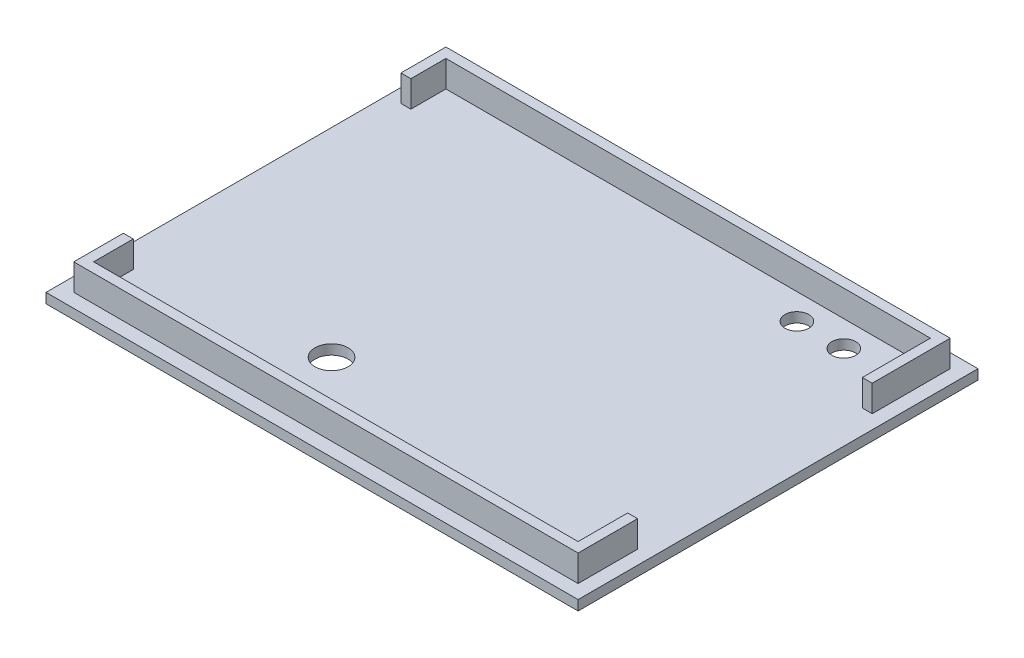
ISO-10303-21;
HEADER;
FILE_DESCRIPTION(('STEP AP214'),'2;1');
FILE_NAME('part.step','',(''),(''),'','','');
FILE_SCHEMA(('AUTOMOTIVE_DESIGN { 1 0 10303 214 1 1 1 1 }'));
ENDSEC;
DATA;
#1=APPLICATION_CONTEXT('core data for automotive mechanical design processes');
#2=APPLICATION_PROTOCOL_DEFINITION('international standard','automotive_design',2000,#1);
#3=PRODUCT_CONTEXT('',#1,'mechanical');
#4=PRODUCT('Part','Part','',(#3));
#5=PRODUCT_RELATED_PRODUCT_CATEGORY('part','',(#4));
#6=PRODUCT_DEFINITION_FORMATION('','',#4);
#7=PRODUCT_DEFINITION_CONTEXT('part definition',#1,'design');
#8=PRODUCT_DEFINITION('design','',#6,#7);
#9=PRODUCT_DEFINITION_SHAPE('','',#8);
#10=(LENGTH_UNIT() NAMED_UNIT(*) SI_UNIT(.MILLI.,.METRE.));
#11=(NAMED_UNIT(*) PLANE_ANGLE_UNIT() SI_UNIT($,.RADIAN.));
#12=(NAMED_UNIT(*) SI_UNIT($,.STERADIAN.) SOLID_ANGLE_UNIT());
#13=UNCERTAINTY_MEASURE_WITH_UNIT(LENGTH_MEASURE(1.E-05),#10,'distance_accuracy_value','');
#14=(GEOMETRIC_REPRESENTATION_CONTEXT(3) GLOBAL_UNCERTAINTY_ASSIGNED_CONTEXT((#13)) GLOBAL_UNIT_ASSIGNED_CONTEXT((#10,
#11,#12)) REPRESENTATION_CONTEXT('',''));
#15=CARTESIAN_POINT('',(0.,0.,0.));
#16=DIRECTION('',(0.,0.,1.));
#17=DIRECTION('',(1.,0.,0.));
#18=AXIS2_PLACEMENT_3D('',#15,#16,#17);
#19=CARTESIAN_POINT('',(0.,5.5,0.));
#20=DIRECTION('',(0.,-1.,0.));
#21=DIRECTION('',(0.,0.,-1.));
#22=AXIS2_PLACEMENT_3D('',#19,#20,#21);
#23=PLANE('',#22);
#24=DIRECTION('',(0.,0.,1.));
#25=VECTOR('',#24,1.);
#26=CARTESIAN_POINT('',(-36.65,5.5,26.65));
#27=LINE('',#26,#25);
#28=CARTESIAN_POINT('',(-36.65,5.5,20.65));
#29=VERTEX_POINT('',#28);
#30=CARTESIAN_POINT('',(-36.65,5.5,26.65));
#31=VERTEX_POINT('',#30);
#32=EDGE_CURVE('E204',#29,#31,#27,.T.);
#33=ORIENTED_EDGE('',*,*,#32,.F.);
#34=DIRECTION('',(1.,0.,0.));
#35=VECTOR('',#34,1.);
#36=CARTESIAN_POINT('',(-36.4,5.5,20.65));
#37=LINE('',#36,#35);
#38=CARTESIAN_POINT('',(-38.15,5.5,20.65));
#39=VERTEX_POINT('',#38);
#40=EDGE_CURVE('E196',#39,#29,#37,.T.);
#41=ORIENTED_EDGE('',*,*,#40,.F.);
#42=DIRECTION('',(0.,0.,1.));
#43=VECTOR('',#42,1.);
#44=CARTESIAN_POINT('',(-38.15,5.5,28.15));
#45=LINE('',#44,#43);
#46=CARTESIAN_POINT('',(-38.15,5.5,28.15));
#47=VERTEX_POINT('',#46);
#48=EDGE_CURVE('E244',#39,#47,#45,.T.);
#49=ORIENTED_EDGE('',*,*,#48,.T.);
#50=DIRECTION('',(1.,0.,0.));
#51=VECTOR('',#50,1.);
#52=CARTESIAN_POINT('',(38.15,5.5,28.15));
#53=LINE('',#52,#51);
#54=CARTESIAN_POINT('',(38.15,5.5,28.15));
#55=VERTEX_POINT('',#54);
#56=EDGE_CURVE('E234',#47,#55,#53,.T.);
#57=ORIENTED_EDGE('',*,*,#56,.T.);
#58=DIRECTION('',(0.,0.,-1.));
#59=VECTOR('',#58,1.);
#60=CARTESIAN_POINT('',(38.15,5.5,28.15));
#61=LINE('',#60,#59);
#62=CARTESIAN_POINT('',(38.15,5.5,19.15));
#63=VERTEX_POINT('',#62);
#64=EDGE_CURVE('E239',#55,#63,#61,.T.);
#65=ORIENTED_EDGE('',*,*,#64,.T.);
#66=DIRECTION('',(1.,0.,0.));
#67=VECTOR('',#66,1.);
#68=CARTESIAN_POINT('',(36.4,5.5,19.15));
#69=LINE('',#68,#67);
#70=CARTESIAN_POINT('',(36.65,5.5,19.15));
#71=VERTEX_POINT('',#70);
#72=EDGE_CURVE('E321',#71,#63,#69,.T.);
#73=ORIENTED_EDGE('',*,*,#72,.F.);
#74=DIRECTION('',(0.,0.,-1.));
#75=VECTOR('',#74,1.);
#76=CARTESIAN_POINT('',(36.65,5.5,26.65));
#77=LINE('',#76,#75);
#78=CARTESIAN_POINT('',(36.65,5.5,26.65));
#79=VERTEX_POINT('',#78);
#80=EDGE_CURVE('E338',#79,#71,#77,.T.);
#81=ORIENTED_EDGE('',*,*,#80,.F.);
#82=DIRECTION('',(1.,0.,0.));
#83=VECTOR('',#82,1.);
#84=CARTESIAN_POINT('',(36.65,5.5,26.65));
#85=LINE('',#84,#83);
#86=EDGE_CURVE('E203',#31,#79,#85,.T.);
#87=ORIENTED_EDGE('',*,*,#86,.F.);
#88=EDGE_LOOP('',(#33,#41,#49,#57,#65,#73,#81,#87));
#89=FACE_BOUND('',#88,.T.);
#90=ADVANCED_FACE('F37',(#89),#23,.F.);
#91=CARTESIAN_POINT('',(-38.15,5.5,28.15));
#92=DIRECTION('',(1.,0.,0.));
#93=DIRECTION('',(0.,0.,-1.));
#94=AXIS2_PLACEMENT_3D('',#91,#92,#93);
#95=PLANE('',#94);
#96=ORIENTED_EDGE('',*,*,#48,.F.);
#97=DIRECTION('',(0.,-1.,0.));
#98=VECTOR('',#97,1.);
#99=CARTESIAN_POINT('',(-38.15,5.5,20.65));
#100=LINE('',#99,#98);
#101=CARTESIAN_POINT('',(-38.15,1.5,20.65));
#102=VERTEX_POINT('',#101);
#103=EDGE_CURVE('E318',#39,#102,#100,.T.);
#104=ORIENTED_EDGE('',*,*,#103,.T.);
#105=DIRECTION('',(0.,0.,1.));
#106=VECTOR('',#105,1.);
#107=CARTESIAN_POINT('',(-38.15,1.5,28.15));
#108=LINE('',#107,#106);
#109=CARTESIAN_POINT('',(-38.15,1.5,28.15));
#110=VERTEX_POINT('',#109);
#111=EDGE_CURVE('E256',#102,#110,#108,.T.);
#112=ORIENTED_EDGE('',*,*,#111,.T.);
#113=DIRECTION('',(0.,-1.,0.));
#114=VECTOR('',#113,1.);
#115=CARTESIAN_POINT('',(-38.15,5.5,28.15));
#116=LINE('',#115,#114);
#117=EDGE_CURVE('E246',#47,#110,#116,.T.);
#118=ORIENTED_EDGE('',*,*,#117,.F.);
#119=EDGE_LOOP('',(#96,#104,#112,#118));
#120=FACE_BOUND('',#119,.T.);
#121=ADVANCED_FACE('F385',(#120),#95,.F.);
#122=CARTESIAN_POINT('',(-36.65,5.5,26.65));
#123=DIRECTION('',(1.,0.,0.));
#124=DIRECTION('',(0.,0.,-1.));
#125=AXIS2_PLACEMENT_3D('',#122,#123,#124);
#126=PLANE('',#125);
#127=DIRECTION('',(0.,-1.,0.));
#128=VECTOR('',#127,1.);
#129=CARTESIAN_POINT('',(-36.65,5.5,20.65));
#130=LINE('',#129,#128);
#131=CARTESIAN_POINT('',(-36.65,1.5,20.65));
#132=VERTEX_POINT('',#131);
#133=EDGE_CURVE('E316',#29,#132,#130,.T.);
#134=ORIENTED_EDGE('',*,*,#133,.F.);
#135=ORIENTED_EDGE('',*,*,#32,.T.);
#136=DIRECTION('',(0.,-1.,0.));
#137=VECTOR('',#136,1.);
#138=CARTESIAN_POINT('',(-36.65,5.5,26.65));
#139=LINE('',#138,#137);
#140=CARTESIAN_POINT('',(-36.65,1.5,26.65));
#141=VERTEX_POINT('',#140);
#142=EDGE_CURVE('E226',#31,#141,#139,.T.);
#143=ORIENTED_EDGE('',*,*,#142,.T.);
#144=DIRECTION('',(0.,0.,1.));
#145=VECTOR('',#144,1.);
#146=CARTESIAN_POINT('',(-36.65,1.5,26.65));
#147=LINE('',#146,#145);
#148=EDGE_CURVE('E218',#132,#141,#147,.T.);
#149=ORIENTED_EDGE('',*,*,#148,.F.);
#150=EDGE_LOOP('',(#134,#135,#143,#149));
#151=FACE_BOUND('',#150,.T.);
#152=ADVANCED_FACE('F391',(#151),#126,.T.);
#153=CARTESIAN_POINT('',(38.15,5.5,28.15));
#154=DIRECTION('',(-1.,0.,0.));
#155=DIRECTION('',(0.,0.,1.));
#156=AXIS2_PLACEMENT_3D('',#153,#154,#155);
#157=PLANE('',#156);
#158=CARTESIAN_POINT('',(38.15,5.5,-16.35));
#159=VERTEX_POINT('',#158);
#160=CARTESIAN_POINT('',(38.15,5.5,-28.15));
#161=VERTEX_POINT('',#160);
#162=EDGE_CURVE('E237',#159,#161,#61,.T.);
#163=ORIENTED_EDGE('',*,*,#162,.F.);
#164=DIRECTION('',(0.,-1.,0.));
#165=VECTOR('',#164,1.);
#166=CARTESIAN_POINT('',(38.15,5.5,-16.35));
#167=LINE('',#166,#165);
#168=CARTESIAN_POINT('',(38.15,1.5,-16.35));
#169=VERTEX_POINT('',#168);
#170=EDGE_CURVE('E336',#159,#169,#167,.T.);
#171=ORIENTED_EDGE('',*,*,#170,.T.);
#172=DIRECTION('',(0.,0.,-1.));
#173=VECTOR('',#172,1.);
#174=CARTESIAN_POINT('',(38.15,1.5,28.15));
#175=LINE('',#174,#173);
#176=CARTESIAN_POINT('',(38.15,1.5,-28.15));
#177=VERTEX_POINT('',#176);
#178=EDGE_CURVE('E249',#169,#177,#175,.T.);
#179=ORIENTED_EDGE('',*,*,#178,.T.);
#180=DIRECTION('',(0.,-1.,0.));
#181=VECTOR('',#180,1.);
#182=CARTESIAN_POINT('',(38.15,5.5,-28.15));
#183=LINE('',#182,#181);
#184=EDGE_CURVE('E263',#161,#177,#183,.T.);
#185=ORIENTED_EDGE('',*,*,#184,.F.);
#186=EDGE_LOOP('',(#163,#171,#179,#185));
#187=FACE_BOUND('',#186,.T.);
#188=ADVANCED_FACE('F367',(#187),#157,.F.);
#189=CARTESIAN_POINT('',(36.65,5.5,26.65));
#190=DIRECTION('',(-1.,0.,0.));
#191=DIRECTION('',(0.,0.,1.));
#192=AXIS2_PLACEMENT_3D('',#189,#190,#191);
#193=PLANE('',#192);
#194=DIRECTION('',(0.,-1.,0.));
#195=VECTOR('',#194,1.);
#196=CARTESIAN_POINT('',(36.65,5.5,-16.35));
#197=LINE('',#196,#195);
#198=CARTESIAN_POINT('',(36.65,5.5,-16.35));
#199=VERTEX_POINT('',#198);
#200=CARTESIAN_POINT('',(36.65,1.5,-16.35));
#201=VERTEX_POINT('',#200);
#202=EDGE_CURVE('E334',#199,#201,#197,.T.);
#203=ORIENTED_EDGE('',*,*,#202,.F.);
#204=CARTESIAN_POINT('',(36.65,5.5,-26.65));
#205=VERTEX_POINT('',#204);
#206=EDGE_CURVE('E223',#199,#205,#77,.T.);
#207=ORIENTED_EDGE('',*,*,#206,.T.);
#208=DIRECTION('',(0.,-1.,0.));
#209=VECTOR('',#208,1.);
#210=CARTESIAN_POINT('',(36.65,5.5,-26.65));
#211=LINE('',#210,#209);
#212=CARTESIAN_POINT('',(36.65,1.5,-26.65));
#213=VERTEX_POINT('',#212);
#214=EDGE_CURVE('E230',#205,#213,#211,.T.);
#215=ORIENTED_EDGE('',*,*,#214,.T.);
#216=DIRECTION('',(0.,0.,-1.));
#217=VECTOR('',#216,1.);
#218=CARTESIAN_POINT('',(36.65,1.5,26.65));
#219=LINE('',#218,#217);
#220=EDGE_CURVE('E216',#201,#213,#219,.T.);
#221=ORIENTED_EDGE('',*,*,#220,.F.);
#222=EDGE_LOOP('',(#203,#207,#215,#221));
#223=FACE_BOUND('',#222,.T.);
#224=ADVANCED_FACE('F348',(#223),#193,.T.);
#225=CARTESIAN_POINT('',(40.25,1.5,30.25));
#226=DIRECTION('',(-1.,0.,0.));
#227=DIRECTION('',(0.,0.,1.));
#228=AXIS2_PLACEMENT_3D('',#225,#226,#227);
#229=PLANE('',#228);
#230=DIRECTION('',(0.,0.,-1.));
#231=VECTOR('',#230,1.);
#232=CARTESIAN_POINT('',(40.25,0.,30.25));
#233=LINE('',#232,#231);
#234=CARTESIAN_POINT('',(40.25,0.,30.25));
#235=VERTEX_POINT('',#234);
#236=CARTESIAN_POINT('',(40.25,0.,-30.25));
#237=VERTEX_POINT('',#236);
#238=EDGE_CURVE('E268',#235,#237,#233,.T.);
#239=ORIENTED_EDGE('',*,*,#238,.T.);
#240=DIRECTION('',(0.,-1.,0.));
#241=VECTOR('',#240,1.);
#242=CARTESIAN_POINT('',(40.25,1.5,-30.25));
#243=LINE('',#242,#241);
#244=CARTESIAN_POINT('',(40.25,1.5,-30.25));
#245=VERTEX_POINT('',#244);
#246=EDGE_CURVE('E11',#245,#237,#243,.T.);
#247=ORIENTED_EDGE('',*,*,#246,.F.);
#248=DIRECTION('',(0.,0.,-1.));
#249=VECTOR('',#248,1.);
#250=CARTESIAN_POINT('',(40.25,1.5,30.25));
#251=LINE('',#250,#249);
#252=CARTESIAN_POINT('',(40.25,1.5,30.25));
#253=VERTEX_POINT('',#252);
#254=EDGE_CURVE('E269',#253,#245,#251,.T.);
#255=ORIENTED_EDGE('',*,*,#254,.F.);
#256=DIRECTION('',(0.,-1.,0.));
#257=VECTOR('',#256,1.);
#258=CARTESIAN_POINT('',(40.25,1.5,30.25));
#259=LINE('',#258,#257);
#260=EDGE_CURVE('E279',#253,#235,#259,.T.);
#261=ORIENTED_EDGE('',*,*,#260,.T.);
#262=EDGE_LOOP('',(#239,#247,#255,#261));
#263=FACE_BOUND('',#262,.T.);
#264=ADVANCED_FACE('F39',(#263),#229,.F.);
#265=CARTESIAN_POINT('',(40.25,1.5,-30.25));
#266=DIRECTION('',(0.,0.,1.));
#267=DIRECTION('',(1.,0.,0.));
#268=AXIS2_PLACEMENT_3D('',#265,#266,#267);
#269=PLANE('',#268);
#270=DIRECTION('',(-1.,0.,0.));
#271=VECTOR('',#270,1.);
#272=CARTESIAN_POINT('',(40.25,0.,-30.25));
#273=LINE('',#272,#271);
#274=CARTESIAN_POINT('',(-40.25,0.,-30.25));
#275=VERTEX_POINT('',#274);
#276=EDGE_CURVE('E282',#237,#275,#273,.T.);
#277=ORIENTED_EDGE('',*,*,#276,.T.);
#278=DIRECTION('',(0.,-1.,0.));
#279=VECTOR('',#278,1.);
#280=CARTESIAN_POINT('',(-40.25,1.5,-30.25));
#281=LINE('',#280,#279);
#282=CARTESIAN_POINT('',(-40.25,1.5,-30.25));
#283=VERTEX_POINT('',#282);
#284=EDGE_CURVE('E46',#283,#275,#281,.T.);
#285=ORIENTED_EDGE('',*,*,#284,.F.);
#286=DIRECTION('',(-1.,0.,0.));
#287=VECTOR('',#286,1.);
#288=CARTESIAN_POINT('',(40.25,1.5,-30.25));
#289=LINE('',#288,#287);
#290=EDGE_CURVE('E272',#245,#283,#289,.T.);
#291=ORIENTED_EDGE('',*,*,#290,.F.);
#292=ORIENTED_EDGE('',*,*,#246,.T.);
#293=EDGE_LOOP('',(#277,#285,#291,#292));
#294=FACE_BOUND('',#293,.T.);
#295=ADVANCED_FACE('F418',(#294),#269,.F.);
#296=CARTESIAN_POINT('',(-40.25,1.5,30.25));
#297=DIRECTION('',(1.,0.,0.));
#298=DIRECTION('',(0.,0.,-1.));
#299=AXIS2_PLACEMENT_3D('',#296,#297,#298);
#300=PLANE('',#299);
#301=DIRECTION('',(0.,0.,1.));
#302=VECTOR('',#301,1.);
#303=CARTESIAN_POINT('',(-40.25,0.,30.25));
#304=LINE('',#303,#302);
#305=CARTESIAN_POINT('',(-40.25,0.,30.25));
#306=VERTEX_POINT('',#305);
#307=EDGE_CURVE('E284',#275,#306,#304,.T.);
#308=ORIENTED_EDGE('',*,*,#307,.T.);
#309=DIRECTION('',(0.,-1.,0.));
#310=VECTOR('',#309,1.);
#311=CARTESIAN_POINT('',(-40.25,1.5,30.25));
#312=LINE('',#311,#310);
#313=CARTESIAN_POINT('',(-40.25,1.5,30.25));
#314=VERTEX_POINT('',#313);
#315=EDGE_CURVE('E289',#314,#306,#312,.T.);
#316=ORIENTED_EDGE('',*,*,#315,.F.);
#317=DIRECTION('',(0.,0.,1.));
#318=VECTOR('',#317,1.);
#319=CARTESIAN_POINT('',(-40.25,1.5,30.25));
#320=LINE('',#319,#318);
#321=EDGE_CURVE('E275',#283,#314,#320,.T.);
#322=ORIENTED_EDGE('',*,*,#321,.F.);
#323=ORIENTED_EDGE('',*,*,#284,.T.);
#324=EDGE_LOOP('',(#308,#316,#322,#323));
#325=FACE_BOUND('',#324,.T.);
#326=ADVANCED_FACE('F412',(#325),#300,.F.);
#327=CARTESIAN_POINT('',(40.25,1.5,30.25));
#328=DIRECTION('',(0.,0.,-1.));
#329=DIRECTION('',(-1.,0.,0.));
#330=AXIS2_PLACEMENT_3D('',#327,#328,#329);
#331=PLANE('',#330);
#332=DIRECTION('',(1.,0.,0.));
#333=VECTOR('',#332,1.);
#334=CARTESIAN_POINT('',(40.25,0.,30.25));
#335=LINE('',#334,#333);
#336=EDGE_CURVE('E273',#306,#235,#335,.T.);
#337=ORIENTED_EDGE('',*,*,#336,.T.);
#338=ORIENTED_EDGE('',*,*,#260,.F.);
#339=DIRECTION('',(1.,0.,0.));
#340=VECTOR('',#339,1.);
#341=CARTESIAN_POINT('',(40.25,1.5,30.25));
#342=LINE('',#341,#340);
#343=EDGE_CURVE('E277',#314,#253,#342,.T.);
#344=ORIENTED_EDGE('',*,*,#343,.F.);
#345=ORIENTED_EDGE('',*,*,#315,.T.);
#346=EDGE_LOOP('',(#337,#338,#344,#345));
#347=FACE_BOUND('',#346,.T.);
#348=ADVANCED_FACE('F406',(#347),#331,.F.);
#349=CARTESIAN_POINT('',(0.,0.,0.));
#350=DIRECTION('',(0.,1.,0.));
#351=DIRECTION('',(0.,0.,1.));
#352=AXIS2_PLACEMENT_3D('',#349,#350,#351);
#353=PLANE('',#352);
#354=CARTESIAN_POINT('',(27.45,0.,-22.75));
#355=DIRECTION('',(0.,-1.,0.));
#356=DIRECTION('',(0.,0.,-1.));
#357=AXIS2_PLACEMENT_3D('',#354,#355,#356);
#358=CIRCLE('',#357,1.8);
#359=CARTESIAN_POINT('',(27.45,0.,-24.55));
#360=VERTEX_POINT('',#359);
#361=EDGE_CURVE('E298',#360,#360,#358,.T.);
#362=ORIENTED_EDGE('',*,*,#361,.F.);
#363=EDGE_LOOP('',(#362));
#364=FACE_BOUND('',#363,.T.);
#365=CARTESIAN_POINT('',(-10.15,0.,17.15));
#366=DIRECTION('',(0.,-1.,0.));
#367=DIRECTION('',(0.,0.,-1.));
#368=AXIS2_PLACEMENT_3D('',#365,#366,#367);
#369=CIRCLE('',#368,2.5);
#370=CARTESIAN_POINT('',(-10.15,0.,14.65));
#371=VERTEX_POINT('',#370);
#372=EDGE_CURVE('E303',#371,#371,#369,.T.);
#373=ORIENTED_EDGE('',*,*,#372,.F.);
#374=EDGE_LOOP('',(#373));
#375=FACE_BOUND('',#374,.T.);
#376=CARTESIAN_POINT('',(20.35,0.,-22.75));
#377=DIRECTION('',(0.,-1.,0.));
#378=DIRECTION('',(0.,0.,-1.));
#379=AXIS2_PLACEMENT_3D('',#376,#377,#378);
#380=CIRCLE('',#379,1.8);
#381=CARTESIAN_POINT('',(20.35,0.,-24.55));
#382=VERTEX_POINT('',#381);
#383=EDGE_CURVE('E295',#382,#382,#380,.T.);
#384=ORIENTED_EDGE('',*,*,#383,.F.);
#385=EDGE_LOOP('',(#384));
#386=FACE_BOUND('',#385,.T.);
#387=ORIENTED_EDGE('',*,*,#238,.F.);
#388=ORIENTED_EDGE('',*,*,#336,.F.);
#389=ORIENTED_EDGE('',*,*,#307,.F.);
#390=ORIENTED_EDGE('',*,*,#276,.F.);
#391=EDGE_LOOP('',(#387,#388,#389,#390));
#392=FACE_BOUND('',#391,.T.);
#393=ADVANCED_FACE('F398',(#364,#375,#386,#392),#353,.F.);
#394=CARTESIAN_POINT('',(-38.15,5.5,-28.15));
#395=VERTEX_POINT('',#394);
#396=CARTESIAN_POINT('',(-38.15,5.5,-21.35));
#397=VERTEX_POINT('',#396);
#398=EDGE_CURVE('E195',#395,#397,#45,.T.);
#399=ORIENTED_EDGE('',*,*,#398,.T.);
#400=DIRECTION('',(-1.,0.,0.));
#401=VECTOR('',#400,1.);
#402=CARTESIAN_POINT('',(-36.4,5.5,-21.35));
#403=LINE('',#402,#401);
#404=CARTESIAN_POINT('',(-36.65,5.5,-21.35));
#405=VERTEX_POINT('',#404);
#406=EDGE_CURVE('E178',#405,#397,#403,.T.);
#407=ORIENTED_EDGE('',*,*,#406,.F.);
#408=CARTESIAN_POINT('',(-36.65,5.5,-26.65));
#409=VERTEX_POINT('',#408);
#410=EDGE_CURVE('E193',#409,#405,#27,.T.);
#411=ORIENTED_EDGE('',*,*,#410,.F.);
#412=DIRECTION('',(-1.,0.,0.));
#413=VECTOR('',#412,1.);
#414=CARTESIAN_POINT('',(36.65,5.5,-26.65));
#415=LINE('',#414,#413);
#416=EDGE_CURVE('E208',#205,#409,#415,.T.);
#417=ORIENTED_EDGE('',*,*,#416,.F.);
#418=ORIENTED_EDGE('',*,*,#206,.F.);
#419=DIRECTION('',(-1.,0.,0.));
#420=VECTOR('',#419,1.);
#421=CARTESIAN_POINT('',(36.4,5.5,-16.35));
#422=LINE('',#421,#420);
#423=EDGE_CURVE('E325',#159,#199,#422,.T.);
#424=ORIENTED_EDGE('',*,*,#423,.F.);
#425=ORIENTED_EDGE('',*,*,#162,.T.);
#426=DIRECTION('',(-1.,0.,0.));
#427=VECTOR('',#426,1.);
#428=CARTESIAN_POINT('',(38.15,5.5,-28.15));
#429=LINE('',#428,#427);
#430=EDGE_CURVE('E242',#161,#395,#429,.T.);
#431=ORIENTED_EDGE('',*,*,#430,.T.);
#432=EDGE_LOOP('',(#399,#407,#411,#417,#418,#424,#425,#431));
#433=FACE_BOUND('',#432,.T.);
#434=ADVANCED_FACE('F191',(#433),#23,.F.);
#435=CARTESIAN_POINT('',(38.15,5.5,28.15));
#436=DIRECTION('',(0.,0.,-1.));
#437=DIRECTION('',(-1.,0.,0.));
#438=AXIS2_PLACEMENT_3D('',#435,#436,#437);
#439=PLANE('',#438);
#440=DIRECTION('',(1.,0.,0.));
#441=VECTOR('',#440,1.);
#442=CARTESIAN_POINT('',(38.15,1.5,28.15));
#443=LINE('',#442,#441);
#444=CARTESIAN_POINT('',(38.15,1.5,28.15));
#445=VERTEX_POINT('',#444);
#446=EDGE_CURVE('E233',#110,#445,#443,.T.);
#447=ORIENTED_EDGE('',*,*,#446,.T.);
#448=DIRECTION('',(0.,-1.,0.));
#449=VECTOR('',#448,1.);
#450=CARTESIAN_POINT('',(38.15,5.5,28.15));
#451=LINE('',#450,#449);
#452=EDGE_CURVE('E266',#55,#445,#451,.T.);
#453=ORIENTED_EDGE('',*,*,#452,.F.);
#454=ORIENTED_EDGE('',*,*,#56,.F.);
#455=ORIENTED_EDGE('',*,*,#117,.T.);
#456=EDGE_LOOP('',(#447,#453,#454,#455));
#457=FACE_BOUND('',#456,.T.);
#458=ADVANCED_FACE('F397',(#457),#439,.F.);
#459=CARTESIAN_POINT('',(38.15,1.5,19.15));
#460=VERTEX_POINT('',#459);
#461=EDGE_CURVE('E250',#445,#460,#175,.T.);
#462=ORIENTED_EDGE('',*,*,#461,.T.);
#463=DIRECTION('',(0.,1.,0.));
#464=VECTOR('',#463,1.);
#465=CARTESIAN_POINT('',(38.15,5.5,19.15));
#466=LINE('',#465,#464);
#467=EDGE_CURVE('E331',#460,#63,#466,.T.);
#468=ORIENTED_EDGE('',*,*,#467,.T.);
#469=ORIENTED_EDGE('',*,*,#64,.F.);
#470=ORIENTED_EDGE('',*,*,#452,.T.);
#471=EDGE_LOOP('',(#462,#468,#469,#470));
#472=FACE_BOUND('',#471,.T.);
#473=ADVANCED_FACE('F403',(#472),#157,.F.);
#474=CARTESIAN_POINT('',(38.15,5.5,-28.15));
#475=DIRECTION('',(0.,0.,1.));
#476=DIRECTION('',(1.,0.,0.));
#477=AXIS2_PLACEMENT_3D('',#474,#475,#476);
#478=PLANE('',#477);
#479=DIRECTION('',(-1.,0.,0.));
#480=VECTOR('',#479,1.);
#481=CARTESIAN_POINT('',(38.15,1.5,-28.15));
#482=LINE('',#481,#480);
#483=CARTESIAN_POINT('',(-38.15,1.5,-28.15));
#484=VERTEX_POINT('',#483);
#485=EDGE_CURVE('E253',#177,#484,#482,.T.);
#486=ORIENTED_EDGE('',*,*,#485,.T.);
#487=DIRECTION('',(0.,-1.,0.));
#488=VECTOR('',#487,1.);
#489=CARTESIAN_POINT('',(-38.15,5.5,-28.15));
#490=LINE('',#489,#488);
#491=EDGE_CURVE('E261',#395,#484,#490,.T.);
#492=ORIENTED_EDGE('',*,*,#491,.F.);
#493=ORIENTED_EDGE('',*,*,#430,.F.);
#494=ORIENTED_EDGE('',*,*,#184,.T.);
#495=EDGE_LOOP('',(#486,#492,#493,#494));
#496=FACE_BOUND('',#495,.T.);
#497=ADVANCED_FACE('F363',(#496),#478,.F.);
#498=CARTESIAN_POINT('',(-38.15,1.5,-21.35));
#499=VERTEX_POINT('',#498);
#500=EDGE_CURVE('E238',#484,#499,#108,.T.);
#501=ORIENTED_EDGE('',*,*,#500,.T.);
#502=DIRECTION('',(0.,1.,0.));
#503=VECTOR('',#502,1.);
#504=CARTESIAN_POINT('',(-38.15,5.5,-21.35));
#505=LINE('',#504,#503);
#506=EDGE_CURVE('E186',#499,#397,#505,.T.);
#507=ORIENTED_EDGE('',*,*,#506,.T.);
#508=ORIENTED_EDGE('',*,*,#398,.F.);
#509=ORIENTED_EDGE('',*,*,#491,.T.);
#510=EDGE_LOOP('',(#501,#507,#508,#509));
#511=FACE_BOUND('',#510,.T.);
#512=ADVANCED_FACE('F359',(#511),#95,.F.);
#513=DIRECTION('',(0.,1.,0.));
#514=VECTOR('',#513,1.);
#515=CARTESIAN_POINT('',(36.65,5.5,19.15));
#516=LINE('',#515,#514);
#517=CARTESIAN_POINT('',(36.65,1.5,19.15));
#518=VERTEX_POINT('',#517);
#519=EDGE_CURVE('E327',#518,#71,#516,.T.);
#520=ORIENTED_EDGE('',*,*,#519,.F.);
#521=CARTESIAN_POINT('',(36.65,1.5,26.65));
#522=VERTEX_POINT('',#521);
#523=EDGE_CURVE('E212',#522,#518,#219,.T.);
#524=ORIENTED_EDGE('',*,*,#523,.F.);
#525=DIRECTION('',(0.,-1.,0.));
#526=VECTOR('',#525,1.);
#527=CARTESIAN_POINT('',(36.65,5.5,26.65));
#528=LINE('',#527,#526);
#529=EDGE_CURVE('E206',#79,#522,#528,.T.);
#530=ORIENTED_EDGE('',*,*,#529,.F.);
#531=ORIENTED_EDGE('',*,*,#80,.T.);
#532=EDGE_LOOP('',(#520,#524,#530,#531));
#533=FACE_BOUND('',#532,.T.);
#534=ADVANCED_FACE('F440',(#533),#193,.T.);
#535=CARTESIAN_POINT('',(36.65,5.5,-26.65));
#536=DIRECTION('',(0.,0.,1.));
#537=DIRECTION('',(1.,0.,0.));
#538=AXIS2_PLACEMENT_3D('',#535,#536,#537);
#539=PLANE('',#538);
#540=DIRECTION('',(-1.,0.,0.));
#541=VECTOR('',#540,1.);
#542=CARTESIAN_POINT('',(36.65,1.5,-26.65));
#543=LINE('',#542,#541);
#544=CARTESIAN_POINT('',(-36.65,1.5,-26.65));
#545=VERTEX_POINT('',#544);
#546=EDGE_CURVE('E215',#213,#545,#543,.T.);
#547=ORIENTED_EDGE('',*,*,#546,.F.);
#548=ORIENTED_EDGE('',*,*,#214,.F.);
#549=ORIENTED_EDGE('',*,*,#416,.T.);
#550=DIRECTION('',(0.,-1.,0.));
#551=VECTOR('',#550,1.);
#552=CARTESIAN_POINT('',(-36.65,5.5,-26.65));
#553=LINE('',#552,#551);
#554=EDGE_CURVE('E202',#409,#545,#553,.T.);
#555=ORIENTED_EDGE('',*,*,#554,.T.);
#556=EDGE_LOOP('',(#547,#548,#549,#555));
#557=FACE_BOUND('',#556,.T.);
#558=ADVANCED_FACE('F353',(#557),#539,.T.);
#559=DIRECTION('',(0.,1.,0.));
#560=VECTOR('',#559,1.);
#561=CARTESIAN_POINT('',(-36.65,5.5,-21.35));
#562=LINE('',#561,#560);
#563=CARTESIAN_POINT('',(-36.65,1.5,-21.35));
#564=VERTEX_POINT('',#563);
#565=EDGE_CURVE('E175',#564,#405,#562,.T.);
#566=ORIENTED_EDGE('',*,*,#565,.F.);
#567=EDGE_CURVE('E219',#545,#564,#147,.T.);
#568=ORIENTED_EDGE('',*,*,#567,.F.);
#569=ORIENTED_EDGE('',*,*,#554,.F.);
#570=ORIENTED_EDGE('',*,*,#410,.T.);
#571=EDGE_LOOP('',(#566,#568,#569,#570));
#572=FACE_BOUND('',#571,.T.);
#573=ADVANCED_FACE('F200',(#572),#126,.T.);
#574=CARTESIAN_POINT('',(36.65,5.5,26.65));
#575=DIRECTION('',(0.,0.,-1.));
#576=DIRECTION('',(-1.,0.,0.));
#577=AXIS2_PLACEMENT_3D('',#574,#575,#576);
#578=PLANE('',#577);
#579=DIRECTION('',(1.,0.,0.));
#580=VECTOR('',#579,1.);
#581=CARTESIAN_POINT('',(36.65,1.5,26.65));
#582=LINE('',#581,#580);
#583=EDGE_CURVE('E221',#141,#522,#582,.T.);
#584=ORIENTED_EDGE('',*,*,#583,.F.);
#585=ORIENTED_EDGE('',*,*,#142,.F.);
#586=ORIENTED_EDGE('',*,*,#86,.T.);
#587=ORIENTED_EDGE('',*,*,#529,.T.);
#588=EDGE_LOOP('',(#584,#585,#586,#587));
#589=FACE_BOUND('',#588,.T.);
#590=ADVANCED_FACE('F380',(#589),#578,.T.);
#591=CARTESIAN_POINT('',(0.,1.5,0.));
#592=DIRECTION('',(0.,1.,0.));
#593=DIRECTION('',(0.,0.,1.));
#594=AXIS2_PLACEMENT_3D('',#591,#592,#593);
#595=PLANE('',#594);
#596=CARTESIAN_POINT('',(27.45,1.5,-22.75));
#597=DIRECTION('',(0.,1.,0.));
#598=DIRECTION('',(0.,0.,1.));
#599=AXIS2_PLACEMENT_3D('',#596,#597,#598);
#600=CIRCLE('',#599,1.8);
#601=CARTESIAN_POINT('',(27.45,1.5,-20.95));
#602=VERTEX_POINT('',#601);
#603=EDGE_CURVE('E41',#602,#602,#600,.T.);
#604=ORIENTED_EDGE('',*,*,#603,.F.);
#605=EDGE_LOOP('',(#604));
#606=FACE_BOUND('',#605,.T.);
#607=CARTESIAN_POINT('',(-10.15,1.5,17.15));
#608=DIRECTION('',(0.,1.,0.));
#609=DIRECTION('',(0.,0.,1.));
#610=AXIS2_PLACEMENT_3D('',#607,#608,#609);
#611=CIRCLE('',#610,2.5);
#612=CARTESIAN_POINT('',(-10.15,1.5,19.65));
#613=VERTEX_POINT('',#612);
#614=EDGE_CURVE('E296',#613,#613,#611,.T.);
#615=ORIENTED_EDGE('',*,*,#614,.F.);
#616=EDGE_LOOP('',(#615));
#617=FACE_BOUND('',#616,.T.);
#618=CARTESIAN_POINT('',(20.35,1.5,-22.75));
#619=DIRECTION('',(0.,1.,0.));
#620=DIRECTION('',(0.,0.,1.));
#621=AXIS2_PLACEMENT_3D('',#618,#619,#620);
#622=CIRCLE('',#621,1.8);
#623=CARTESIAN_POINT('',(20.35,1.5,-20.95));
#624=VERTEX_POINT('',#623);
#625=EDGE_CURVE('E197',#624,#624,#622,.T.);
#626=ORIENTED_EDGE('',*,*,#625,.F.);
#627=EDGE_LOOP('',(#626));
#628=FACE_BOUND('',#627,.T.);
#629=ORIENTED_EDGE('',*,*,#111,.F.);
#630=DIRECTION('',(1.,0.,0.));
#631=VECTOR('',#630,1.);
#632=CARTESIAN_POINT('',(-36.4,1.5,20.65));
#633=LINE('',#632,#631);
#634=EDGE_CURVE('E54',#102,#132,#633,.T.);
#635=ORIENTED_EDGE('',*,*,#634,.T.);
#636=ORIENTED_EDGE('',*,*,#148,.T.);
#637=ORIENTED_EDGE('',*,*,#583,.T.);
#638=ORIENTED_EDGE('',*,*,#523,.T.);
#639=DIRECTION('',(1.,0.,0.));
#640=VECTOR('',#639,1.);
#641=CARTESIAN_POINT('',(36.4,1.5,19.15));
#642=LINE('',#641,#640);
#643=EDGE_CURVE('E322',#518,#460,#642,.T.);
#644=ORIENTED_EDGE('',*,*,#643,.T.);
#645=ORIENTED_EDGE('',*,*,#461,.F.);
#646=ORIENTED_EDGE('',*,*,#446,.F.);
#647=EDGE_LOOP('',(#629,#635,#636,#637,#638,#644,#645,#646));
#648=FACE_BOUND('',#647,.T.);
#649=DIRECTION('',(-1.,0.,0.));
#650=VECTOR('',#649,1.);
#651=CARTESIAN_POINT('',(-36.4,1.5,-21.35));
#652=LINE('',#651,#650);
#653=EDGE_CURVE('E181',#564,#499,#652,.T.);
#654=ORIENTED_EDGE('',*,*,#653,.T.);
#655=ORIENTED_EDGE('',*,*,#500,.F.);
#656=ORIENTED_EDGE('',*,*,#485,.F.);
#657=ORIENTED_EDGE('',*,*,#178,.F.);
#658=DIRECTION('',(-1.,0.,0.));
#659=VECTOR('',#658,1.);
#660=CARTESIAN_POINT('',(36.4,1.5,-16.35));
#661=LINE('',#660,#659);
#662=EDGE_CURVE('E62',#169,#201,#661,.T.);
#663=ORIENTED_EDGE('',*,*,#662,.T.);
#664=ORIENTED_EDGE('',*,*,#220,.T.);
#665=ORIENTED_EDGE('',*,*,#546,.T.);
#666=ORIENTED_EDGE('',*,*,#567,.T.);
#667=EDGE_LOOP('',(#654,#655,#656,#657,#663,#664,#665,#666));
#668=FACE_BOUND('',#667,.T.);
#669=ORIENTED_EDGE('',*,*,#254,.T.);
#670=ORIENTED_EDGE('',*,*,#290,.T.);
#671=ORIENTED_EDGE('',*,*,#321,.T.);
#672=ORIENTED_EDGE('',*,*,#343,.T.);
#673=EDGE_LOOP('',(#669,#670,#671,#672));
#674=FACE_BOUND('',#673,.T.);
#675=ADVANCED_FACE('F354',(#606,#617,#628,#648,#668,#674),#595,.T.);
#676=CARTESIAN_POINT('',(36.4,1.5,-16.35));
#677=DIRECTION('',(0.,0.,-1.));
#678=DIRECTION('',(-1.,0.,0.));
#679=AXIS2_PLACEMENT_3D('',#676,#677,#678);
#680=PLANE('',#679);
#681=ORIENTED_EDGE('',*,*,#423,.T.);
#682=ORIENTED_EDGE('',*,*,#202,.T.);
#683=ORIENTED_EDGE('',*,*,#662,.F.);
#684=ORIENTED_EDGE('',*,*,#170,.F.);
#685=EDGE_LOOP('',(#681,#682,#683,#684));
#686=FACE_BOUND('',#685,.T.);
#687=ADVANCED_FACE('F369',(#686),#680,.F.);
#688=CARTESIAN_POINT('',(36.4,1.5,19.15));
#689=DIRECTION('',(0.,0.,1.));
#690=DIRECTION('',(1.,0.,0.));
#691=AXIS2_PLACEMENT_3D('',#688,#689,#690);
#692=PLANE('',#691);
#693=ORIENTED_EDGE('',*,*,#643,.F.);
#694=ORIENTED_EDGE('',*,*,#519,.T.);
#695=ORIENTED_EDGE('',*,*,#72,.T.);
#696=ORIENTED_EDGE('',*,*,#467,.F.);
#697=EDGE_LOOP('',(#693,#694,#695,#696));
#698=FACE_BOUND('',#697,.T.);
#699=ADVANCED_FACE('F371',(#698),#692,.F.);
#700=CARTESIAN_POINT('',(-36.4,1.5,20.65));
#701=DIRECTION('',(0.,0.,1.));
#702=DIRECTION('',(1.,0.,0.));
#703=AXIS2_PLACEMENT_3D('',#700,#701,#702);
#704=PLANE('',#703);
#705=ORIENTED_EDGE('',*,*,#40,.T.);
#706=ORIENTED_EDGE('',*,*,#133,.T.);
#707=ORIENTED_EDGE('',*,*,#634,.F.);
#708=ORIENTED_EDGE('',*,*,#103,.F.);
#709=EDGE_LOOP('',(#705,#706,#707,#708));
#710=FACE_BOUND('',#709,.T.);
#711=ADVANCED_FACE('F377',(#710),#704,.F.);
#712=CARTESIAN_POINT('',(-36.4,1.5,-21.35));
#713=DIRECTION('',(0.,0.,-1.));
#714=DIRECTION('',(-1.,0.,0.));
#715=AXIS2_PLACEMENT_3D('',#712,#713,#714);
#716=PLANE('',#715);
#717=ORIENTED_EDGE('',*,*,#653,.F.);
#718=ORIENTED_EDGE('',*,*,#565,.T.);
#719=ORIENTED_EDGE('',*,*,#406,.T.);
#720=ORIENTED_EDGE('',*,*,#506,.F.);
#721=EDGE_LOOP('',(#717,#718,#719,#720));
#722=FACE_BOUND('',#721,.T.);
#723=ADVANCED_FACE('F177',(#722),#716,.F.);
#724=CARTESIAN_POINT('',(20.35,3.,-22.75));
#725=DIRECTION('',(0.,-1.,0.));
#726=DIRECTION('',(0.,0.,-1.));
#727=AXIS2_PLACEMENT_3D('',#724,#725,#726);
#728=CYLINDRICAL_SURFACE('',#727,1.8);
#729=ORIENTED_EDGE('',*,*,#625,.T.);
#730=EDGE_LOOP('',(#729));
#731=FACE_BOUND('',#730,.T.);
#732=ORIENTED_EDGE('',*,*,#383,.T.);
#733=EDGE_LOOP('',(#732));
#734=FACE_BOUND('',#733,.T.);
#735=ADVANCED_FACE('F496',(#731,#734),#728,.F.);
#736=CARTESIAN_POINT('',(-10.15,3.,17.15));
#737=DIRECTION('',(0.,-1.,0.));
#738=DIRECTION('',(0.,0.,-1.));
#739=AXIS2_PLACEMENT_3D('',#736,#737,#738);
#740=CYLINDRICAL_SURFACE('',#739,2.5);
#741=ORIENTED_EDGE('',*,*,#614,.T.);
#742=EDGE_LOOP('',(#741));
#743=FACE_BOUND('',#742,.T.);
#744=ORIENTED_EDGE('',*,*,#372,.T.);
#745=EDGE_LOOP('',(#744));
#746=FACE_BOUND('',#745,.T.);
#747=ADVANCED_FACE('F501',(#743,#746),#740,.F.);
#748=CARTESIAN_POINT('',(27.45,3.,-22.75));
#749=DIRECTION('',(0.,-1.,0.));
#750=DIRECTION('',(0.,0.,-1.));
#751=AXIS2_PLACEMENT_3D('',#748,#749,#750);
#752=CYLINDRICAL_SURFACE('',#751,1.8);
#753=ORIENTED_EDGE('',*,*,#603,.T.);
#754=EDGE_LOOP('',(#753));
#755=FACE_BOUND('',#754,.T.);
#756=ORIENTED_EDGE('',*,*,#361,.T.);
#757=EDGE_LOOP('',(#756));
#758=FACE_BOUND('',#757,.T.);
#759=ADVANCED_FACE('F513',(#755,#758),#752,.F.);
#760=CLOSED_SHELL('',(#90,#121,#152,#188,#224,#264,#295,#326,#348,#393,#434,#458,#473,#497,#512,
#534,#558,#573,#590,#675,#687,#699,#711,#723,#735,#747,#759));
#761=MANIFOLD_SOLID_BREP('B2',#760);
#762=ADVANCED_BREP_SHAPE_REPRESENTATION('',(#18,#761),#14);
#763=SHAPE_DEFINITION_REPRESENTATION(#9,#762);
ENDSEC;
END-ISO-10303-21;
